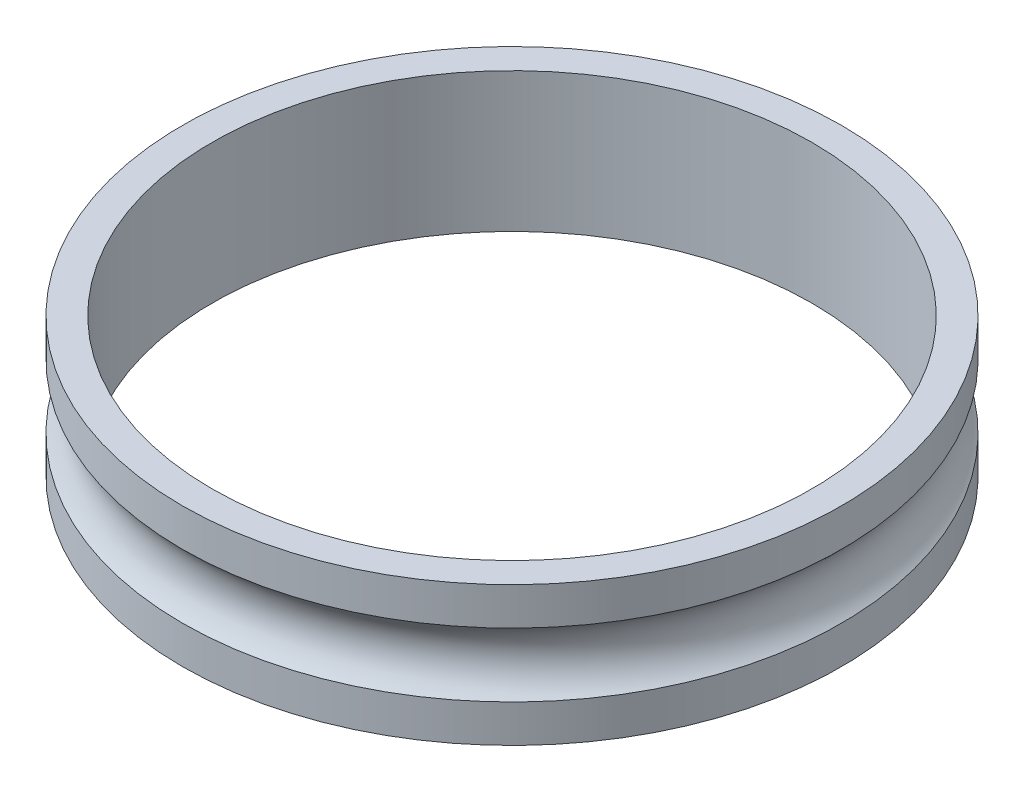
ISO-10303-21;
HEADER;
FILE_DESCRIPTION(('STEP AP214'),'2;1');
FILE_NAME('part.step','',(''),(''),'','','');
FILE_SCHEMA(('AUTOMOTIVE_DESIGN { 1 0 10303 214 1 1 1 1 }'));
ENDSEC;
DATA;
#1=APPLICATION_CONTEXT('core data for automotive mechanical design processes');
#2=APPLICATION_PROTOCOL_DEFINITION('international standard','automotive_design',2000,#1);
#3=PRODUCT_CONTEXT('',#1,'mechanical');
#4=PRODUCT('Part','Part','',(#3));
#5=PRODUCT_RELATED_PRODUCT_CATEGORY('part','',(#4));
#6=PRODUCT_DEFINITION_FORMATION('','',#4);
#7=PRODUCT_DEFINITION_CONTEXT('part definition',#1,'design');
#8=PRODUCT_DEFINITION('design','',#6,#7);
#9=PRODUCT_DEFINITION_SHAPE('','',#8);
#10=(LENGTH_UNIT() NAMED_UNIT(*) SI_UNIT(.MILLI.,.METRE.));
#11=(NAMED_UNIT(*) PLANE_ANGLE_UNIT() SI_UNIT($,.RADIAN.));
#12=(NAMED_UNIT(*) SI_UNIT($,.STERADIAN.) SOLID_ANGLE_UNIT());
#13=UNCERTAINTY_MEASURE_WITH_UNIT(LENGTH_MEASURE(1.E-05),#10,'distance_accuracy_value','');
#14=(GEOMETRIC_REPRESENTATION_CONTEXT(3) GLOBAL_UNCERTAINTY_ASSIGNED_CONTEXT((#13)) GLOBAL_UNIT_ASSIGNED_CONTEXT((#10,
#11,#12)) REPRESENTATION_CONTEXT('',''));
#15=CARTESIAN_POINT('',(0.,0.,0.));
#16=DIRECTION('',(0.,0.,1.));
#17=DIRECTION('',(1.,0.,0.));
#18=AXIS2_PLACEMENT_3D('',#15,#16,#17);
#19=CARTESIAN_POINT('',(7.81,0.,0.));
#20=DIRECTION('',(0.,1.,0.));
#21=DIRECTION('',(0.,0.,1.));
#22=AXIS2_PLACEMENT_3D('',#19,#20,#21);
#23=PLANE('',#22);
#24=CARTESIAN_POINT('',(0.,0.,0.));
#25=DIRECTION('',(0.,-1.,0.));
#26=DIRECTION('',(0.,0.,-1.));
#27=AXIS2_PLACEMENT_3D('',#24,#25,#26);
#28=CIRCLE('',#27,7.11);
#29=CARTESIAN_POINT('',(0.,0.,-7.11));
#30=VERTEX_POINT('',#29);
#31=EDGE_CURVE('E19',#30,#30,#28,.T.);
#32=ORIENTED_EDGE('',*,*,#31,.T.);
#33=EDGE_LOOP('',(#32));
#34=FACE_BOUND('',#33,.T.);
#35=CARTESIAN_POINT('',(0.,0.,0.));
#36=DIRECTION('',(0.,-1.,0.));
#37=DIRECTION('',(0.,0.,-1.));
#38=AXIS2_PLACEMENT_3D('',#35,#36,#37);
#39=CIRCLE('',#38,7.81);
#40=CARTESIAN_POINT('',(0.,0.,-7.81));
#41=VERTEX_POINT('',#40);
#42=EDGE_CURVE('E43',#41,#41,#39,.T.);
#43=ORIENTED_EDGE('',*,*,#42,.F.);
#44=EDGE_LOOP('',(#43));
#45=FACE_BOUND('',#44,.T.);
#46=ADVANCED_FACE('F15',(#34,#45),#23,.T.);
#47=CARTESIAN_POINT('',(0.,0.,0.));
#48=DIRECTION('',(0.,-1.,0.));
#49=DIRECTION('',(0.,0.,-1.));
#50=AXIS2_PLACEMENT_3D('',#47,#48,#49);
#51=CYLINDRICAL_SURFACE('',#50,7.11);
#52=CARTESIAN_POINT('',(0.,-3.3,0.));
#53=DIRECTION('',(0.,-1.,0.));
#54=DIRECTION('',(0.,0.,-1.));
#55=AXIS2_PLACEMENT_3D('',#52,#53,#54);
#56=CIRCLE('',#55,7.11);
#57=CARTESIAN_POINT('',(0.,-3.3,-7.11));
#58=VERTEX_POINT('',#57);
#59=EDGE_CURVE('E40',#58,#58,#56,.T.);
#60=ORIENTED_EDGE('',*,*,#59,.T.);
#61=EDGE_LOOP('',(#60));
#62=FACE_BOUND('',#61,.T.);
#63=ORIENTED_EDGE('',*,*,#31,.F.);
#64=EDGE_LOOP('',(#63));
#65=FACE_BOUND('',#64,.T.);
#66=ADVANCED_FACE('F58',(#62,#65),#51,.F.);
#67=CARTESIAN_POINT('',(7.11,-3.3,0.));
#68=DIRECTION('',(0.,-1.,0.));
#69=DIRECTION('',(0.,0.,-1.));
#70=AXIS2_PLACEMENT_3D('',#67,#68,#69);
#71=PLANE('',#70);
#72=CARTESIAN_POINT('',(0.,-3.3,0.));
#73=DIRECTION('',(0.,-1.,0.));
#74=DIRECTION('',(0.,0.,-1.));
#75=AXIS2_PLACEMENT_3D('',#72,#73,#74);
#76=CIRCLE('',#75,7.81);
#77=CARTESIAN_POINT('',(0.,-3.3,-7.81));
#78=VERTEX_POINT('',#77);
#79=EDGE_CURVE('E34',#78,#78,#76,.T.);
#80=ORIENTED_EDGE('',*,*,#79,.T.);
#81=EDGE_LOOP('',(#80));
#82=FACE_BOUND('',#81,.T.);
#83=ORIENTED_EDGE('',*,*,#59,.F.);
#84=EDGE_LOOP('',(#83));
#85=FACE_BOUND('',#84,.T.);
#86=ADVANCED_FACE('F60',(#82,#85),#71,.T.);
#87=CARTESIAN_POINT('',(0.,0.,0.));
#88=DIRECTION('',(0.,-1.,0.));
#89=DIRECTION('',(0.,0.,-1.));
#90=AXIS2_PLACEMENT_3D('',#87,#88,#89);
#91=CYLINDRICAL_SURFACE('',#90,7.81000000000123);
#92=CARTESIAN_POINT('',(0.,-2.40778872385596,0.));
#93=DIRECTION('',(0.,-1.,0.));
#94=DIRECTION('',(0.,0.,-1.));
#95=AXIS2_PLACEMENT_3D('',#92,#93,#94);
#96=CIRCLE('',#95,7.81000000000248);
#97=CARTESIAN_POINT('',(0.,-2.40778872385596,-7.81000000000248));
#98=VERTEX_POINT('',#97);
#99=EDGE_CURVE('E24',#98,#98,#96,.T.);
#100=ORIENTED_EDGE('',*,*,#99,.T.);
#101=EDGE_LOOP('',(#100));
#102=FACE_BOUND('',#101,.T.);
#103=ORIENTED_EDGE('',*,*,#79,.F.);
#104=EDGE_LOOP('',(#103));
#105=FACE_BOUND('',#104,.T.);
#106=ADVANCED_FACE('F68',(#102,#105),#91,.T.);
#107=CARTESIAN_POINT('',(0.,-1.65,0.));
#108=DIRECTION('',(0.,-1.,0.));
#109=DIRECTION('',(0.,0.,-1.));
#110=AXIS2_PLACEMENT_3D('',#107,#108,#109);
#111=TOROIDAL_SURFACE('',#110,8.4625,1.);
#112=CARTESIAN_POINT('',(0.,-0.892211276147541,0.));
#113=DIRECTION('',(0.,-1.,0.));
#114=DIRECTION('',(0.,0.,-1.));
#115=AXIS2_PLACEMENT_3D('',#112,#113,#114);
#116=CIRCLE('',#115,7.80999999999842);
#117=CARTESIAN_POINT('',(0.,-0.892211276147541,-7.80999999999842));
#118=VERTEX_POINT('',#117);
#119=EDGE_CURVE('E10',#118,#118,#116,.T.);
#120=ORIENTED_EDGE('',*,*,#119,.T.);
#121=EDGE_LOOP('',(#120));
#122=FACE_BOUND('',#121,.T.);
#123=ORIENTED_EDGE('',*,*,#99,.F.);
#124=EDGE_LOOP('',(#123));
#125=FACE_BOUND('',#124,.T.);
#126=ADVANCED_FACE('F74',(#122,#125),#111,.F.);
#127=CARTESIAN_POINT('',(0.,0.,0.));
#128=DIRECTION('',(0.,-1.,0.));
#129=DIRECTION('',(0.,0.,-1.));
#130=AXIS2_PLACEMENT_3D('',#127,#128,#129);
#131=CYLINDRICAL_SURFACE('',#130,7.80999999999921);
#132=ORIENTED_EDGE('',*,*,#42,.T.);
#133=EDGE_LOOP('',(#132));
#134=FACE_BOUND('',#133,.T.);
#135=ORIENTED_EDGE('',*,*,#119,.F.);
#136=EDGE_LOOP('',(#135));
#137=FACE_BOUND('',#136,.T.);
#138=ADVANCED_FACE('F17',(#134,#137),#131,.T.);
#139=CLOSED_SHELL('',(#46,#66,#86,#106,#126,#138));
#140=MANIFOLD_SOLID_BREP('B1',#139);
#141=ADVANCED_BREP_SHAPE_REPRESENTATION('',(#18,#140),#14);
#142=SHAPE_DEFINITION_REPRESENTATION(#9,#141);
ENDSEC;
END-ISO-10303-21;
